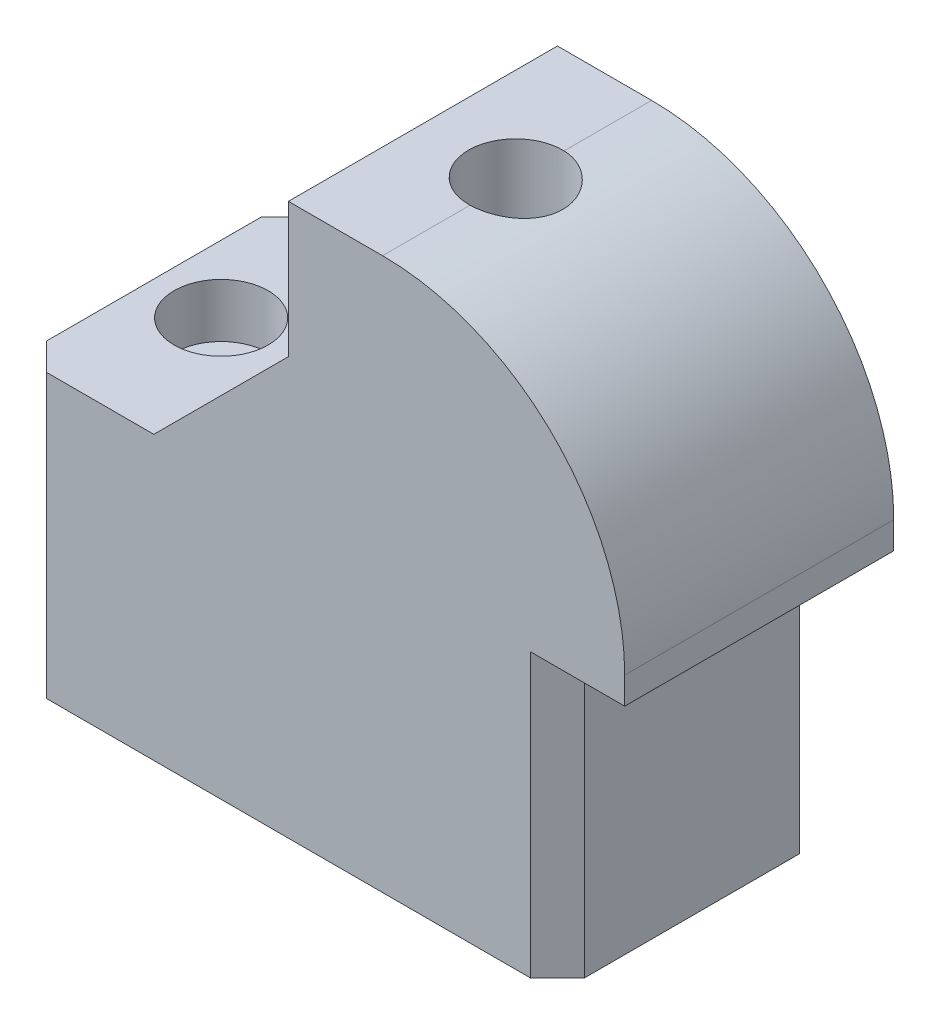
ISO-10303-21;
HEADER;
FILE_DESCRIPTION(('STEP AP214'),'2;1');
FILE_NAME('part.step','',(''),(''),'','','');
FILE_SCHEMA(('AUTOMOTIVE_DESIGN { 1 0 10303 214 1 1 1 1 }'));
ENDSEC;
DATA;
#1=APPLICATION_CONTEXT('core data for automotive mechanical design processes');
#2=APPLICATION_PROTOCOL_DEFINITION('international standard','automotive_design',2000,#1);
#3=PRODUCT_CONTEXT('',#1,'mechanical');
#4=PRODUCT('Part','Part','',(#3));
#5=PRODUCT_RELATED_PRODUCT_CATEGORY('part','',(#4));
#6=PRODUCT_DEFINITION_FORMATION('','',#4);
#7=PRODUCT_DEFINITION_CONTEXT('part definition',#1,'design');
#8=PRODUCT_DEFINITION('design','',#6,#7);
#9=PRODUCT_DEFINITION_SHAPE('','',#8);
#10=(LENGTH_UNIT() NAMED_UNIT(*) SI_UNIT(.MILLI.,.METRE.));
#11=(NAMED_UNIT(*) PLANE_ANGLE_UNIT() SI_UNIT($,.RADIAN.));
#12=(NAMED_UNIT(*) SI_UNIT($,.STERADIAN.) SOLID_ANGLE_UNIT());
#13=UNCERTAINTY_MEASURE_WITH_UNIT(LENGTH_MEASURE(1.E-05),#10,'distance_accuracy_value','');
#14=(GEOMETRIC_REPRESENTATION_CONTEXT(3) GLOBAL_UNCERTAINTY_ASSIGNED_CONTEXT((#13)) GLOBAL_UNIT_ASSIGNED_CONTEXT((#10,
#11,#12)) REPRESENTATION_CONTEXT('',''));
#15=CARTESIAN_POINT('',(0.,0.,0.));
#16=DIRECTION('',(0.,0.,1.));
#17=DIRECTION('',(1.,0.,0.));
#18=AXIS2_PLACEMENT_3D('',#15,#16,#17);
#19=CARTESIAN_POINT('',(-29.339108581,0.,0.));
#20=DIRECTION('',(0.,1.,0.));
#21=DIRECTION('',(0.,0.,1.));
#22=AXIS2_PLACEMENT_3D('',#19,#20,#21);
#23=CYLINDRICAL_SURFACE('',#22,2.413);
#24=CARTESIAN_POINT('',(-29.339108581,0.,0.));
#25=DIRECTION('',(0.,1.,0.));
#26=DIRECTION('',(0.,0.,1.));
#27=AXIS2_PLACEMENT_3D('',#24,#25,#26);
#28=CIRCLE('',#27,2.413);
#29=CARTESIAN_POINT('',(-29.339108581,0.,2.413));
#30=VERTEX_POINT('',#29);
#31=EDGE_CURVE('E449',#30,#30,#28,.T.);
#32=ORIENTED_EDGE('',*,*,#31,.F.);
#33=EDGE_LOOP('',(#32));
#34=FACE_BOUND('',#33,.T.);
#35=CARTESIAN_POINT('',(-29.339108581,21.59,0.));
#36=DIRECTION('',(0.,1.,0.));
#37=DIRECTION('',(0.,0.,1.));
#38=AXIS2_PLACEMENT_3D('',#35,#36,#37);
#39=CIRCLE('',#38,2.413);
#40=CARTESIAN_POINT('',(-29.339108581,21.59,2.413));
#41=VERTEX_POINT('',#40);
#42=EDGE_CURVE('E433',#41,#41,#39,.T.);
#43=ORIENTED_EDGE('',*,*,#42,.T.);
#44=EDGE_LOOP('',(#43));
#45=FACE_BOUND('',#44,.T.);
#46=ADVANCED_FACE('F43',(#34,#45),#23,.F.);
#47=CARTESIAN_POINT('',(-57.15,0.,0.));
#48=DIRECTION('',(0.,1.,0.));
#49=DIRECTION('',(0.,0.,1.));
#50=AXIS2_PLACEMENT_3D('',#47,#48,#49);
#51=CYLINDRICAL_SURFACE('',#50,2.413);
#52=CARTESIAN_POINT('',(-57.15,0.,0.));
#53=DIRECTION('',(0.,1.,0.));
#54=DIRECTION('',(0.,0.,1.));
#55=AXIS2_PLACEMENT_3D('',#52,#53,#54);
#56=CIRCLE('',#55,2.413);
#57=CARTESIAN_POINT('',(-57.15,0.,2.413));
#58=VERTEX_POINT('',#57);
#59=EDGE_CURVE('E175',#58,#58,#56,.T.);
#60=ORIENTED_EDGE('',*,*,#59,.F.);
#61=EDGE_LOOP('',(#60));
#62=FACE_BOUND('',#61,.T.);
#63=CARTESIAN_POINT('',(-57.15,21.59,0.));
#64=DIRECTION('',(0.,1.,0.));
#65=DIRECTION('',(0.,0.,1.));
#66=AXIS2_PLACEMENT_3D('',#63,#64,#65);
#67=CIRCLE('',#66,2.413);
#68=CARTESIAN_POINT('',(-57.15,21.59,2.413));
#69=VERTEX_POINT('',#68);
#70=EDGE_CURVE('E440',#69,#69,#67,.T.);
#71=ORIENTED_EDGE('',*,*,#70,.T.);
#72=EDGE_LOOP('',(#71));
#73=FACE_BOUND('',#72,.T.);
#74=ADVANCED_FACE('F324',(#62,#73),#51,.F.);
#75=CARTESIAN_POINT('',(-12.7,26.67,0.));
#76=DIRECTION('',(1.,0.,0.));
#77=DIRECTION('',(0.,0.,-1.));
#78=AXIS2_PLACEMENT_3D('',#75,#76,#77);
#79=PLANE('',#78);
#80=DIRECTION('',(0.,0.,1.));
#81=VECTOR('',#80,1.);
#82=CARTESIAN_POINT('',(-12.7,0.,0.));
#83=LINE('',#82,#81);
#84=CARTESIAN_POINT('',(-12.7,0.,-10.16));
#85=VERTEX_POINT('',#84);
#86=CARTESIAN_POINT('',(-12.7,0.,10.16));
#87=VERTEX_POINT('',#86);
#88=EDGE_CURVE('E231',#85,#87,#83,.T.);
#89=ORIENTED_EDGE('',*,*,#88,.F.);
#90=DIRECTION('',(0.,1.,0.));
#91=VECTOR('',#90,1.);
#92=CARTESIAN_POINT('',(-12.7,26.67,-10.16));
#93=LINE('',#92,#91);
#94=CARTESIAN_POINT('',(-12.7,26.67,-10.16));
#95=VERTEX_POINT('',#94);
#96=EDGE_CURVE('E273',#85,#95,#93,.T.);
#97=ORIENTED_EDGE('',*,*,#96,.T.);
#98=DIRECTION('',(0.,0.,1.));
#99=VECTOR('',#98,1.);
#100=CARTESIAN_POINT('',(-12.7,26.67,-12.7));
#101=LINE('',#100,#99);
#102=CARTESIAN_POINT('',(-12.7,26.67,10.16));
#103=VERTEX_POINT('',#102);
#104=EDGE_CURVE('E183',#95,#103,#101,.T.);
#105=ORIENTED_EDGE('',*,*,#104,.T.);
#106=DIRECTION('',(0.,-1.,0.));
#107=VECTOR('',#106,1.);
#108=CARTESIAN_POINT('',(-12.7,26.67,10.16));
#109=LINE('',#108,#107);
#110=EDGE_CURVE('E269',#103,#87,#109,.T.);
#111=ORIENTED_EDGE('',*,*,#110,.T.);
#112=EDGE_LOOP('',(#89,#97,#105,#111));
#113=FACE_BOUND('',#112,.T.);
#114=ADVANCED_FACE('F327',(#113),#79,.T.);
#115=CARTESIAN_POINT('',(-63.5,26.67,0.));
#116=DIRECTION('',(-1.,0.,0.));
#117=DIRECTION('',(0.,0.,1.));
#118=AXIS2_PLACEMENT_3D('',#115,#116,#117);
#119=PLANE('',#118);
#120=DIRECTION('',(0.,0.,-1.));
#121=VECTOR('',#120,1.);
#122=CARTESIAN_POINT('',(-63.5,0.,0.));
#123=LINE('',#122,#121);
#124=CARTESIAN_POINT('',(-63.5,0.,10.16));
#125=VERTEX_POINT('',#124);
#126=CARTESIAN_POINT('',(-63.5,0.,-10.16));
#127=VERTEX_POINT('',#126);
#128=EDGE_CURVE('E209',#125,#127,#123,.T.);
#129=ORIENTED_EDGE('',*,*,#128,.F.);
#130=DIRECTION('',(0.,1.,0.));
#131=VECTOR('',#130,1.);
#132=CARTESIAN_POINT('',(-63.5,26.67,10.16));
#133=LINE('',#132,#131);
#134=CARTESIAN_POINT('',(-63.5,26.67,10.16));
#135=VERTEX_POINT('',#134);
#136=EDGE_CURVE('E286',#125,#135,#133,.T.);
#137=ORIENTED_EDGE('',*,*,#136,.T.);
#138=DIRECTION('',(0.,0.,-1.));
#139=VECTOR('',#138,1.);
#140=CARTESIAN_POINT('',(-63.5,26.67,0.));
#141=LINE('',#140,#139);
#142=CARTESIAN_POINT('',(-63.5,26.67,-10.16));
#143=VERTEX_POINT('',#142);
#144=EDGE_CURVE('E210',#135,#143,#141,.T.);
#145=ORIENTED_EDGE('',*,*,#144,.T.);
#146=DIRECTION('',(0.,-1.,0.));
#147=VECTOR('',#146,1.);
#148=CARTESIAN_POINT('',(-63.5,0.,-10.16));
#149=LINE('',#148,#147);
#150=EDGE_CURVE('E282',#143,#127,#149,.T.);
#151=ORIENTED_EDGE('',*,*,#150,.T.);
#152=EDGE_LOOP('',(#129,#137,#145,#151));
#153=FACE_BOUND('',#152,.T.);
#154=ADVANCED_FACE('F358',(#153),#119,.T.);
#155=CARTESIAN_POINT('',(0.,26.67,12.7));
#156=DIRECTION('',(0.,0.,1.));
#157=DIRECTION('',(1.,0.,0.));
#158=AXIS2_PLACEMENT_3D('',#155,#156,#157);
#159=PLANE('',#158);
#160=DIRECTION('',(0.,-1.,0.));
#161=VECTOR('',#160,1.);
#162=CARTESIAN_POINT('',(-6.34999999999999,52.07,12.7));
#163=LINE('',#162,#161);
#164=CARTESIAN_POINT('',(-6.34999999999999,29.21,12.7));
#165=VERTEX_POINT('',#164);
#166=CARTESIAN_POINT('',(-6.34999999999999,26.67,12.7));
#167=VERTEX_POINT('',#166);
#168=EDGE_CURVE('E152',#165,#167,#163,.T.);
#169=ORIENTED_EDGE('',*,*,#168,.F.);
#170=CARTESIAN_POINT('',(-29.21,29.21,12.7));
#171=DIRECTION('',(0.,0.,1.));
#172=DIRECTION('',(1.,0.,0.));
#173=AXIS2_PLACEMENT_3D('',#170,#171,#172);
#174=CIRCLE('',#173,22.86);
#175=CARTESIAN_POINT('',(-29.21,52.07,12.7));
#176=VERTEX_POINT('',#175);
#177=EDGE_CURVE('E303',#165,#176,#174,.T.);
#178=ORIENTED_EDGE('',*,*,#177,.T.);
#179=DIRECTION('',(1.,0.,0.));
#180=VECTOR('',#179,1.);
#181=CARTESIAN_POINT('',(-12.7,52.07,12.7));
#182=LINE('',#181,#180);
#183=CARTESIAN_POINT('',(-38.1,52.07,12.7));
#184=VERTEX_POINT('',#183);
#185=EDGE_CURVE('E197',#184,#176,#182,.T.);
#186=ORIENTED_EDGE('',*,*,#185,.F.);
#187=DIRECTION('',(0.,-1.,0.));
#188=VECTOR('',#187,1.);
#189=CARTESIAN_POINT('',(-38.1,52.07,12.7));
#190=LINE('',#189,#188);
#191=CARTESIAN_POINT('',(-38.1,39.37,12.7));
#192=VERTEX_POINT('',#191);
#193=EDGE_CURVE('E201',#184,#192,#190,.T.);
#194=ORIENTED_EDGE('',*,*,#193,.T.);
#195=DIRECTION('',(-0.707106781186551,-0.707106781186544,0.));
#196=VECTOR('',#195,1.);
#197=CARTESIAN_POINT('',(-38.1,39.37,12.7));
#198=LINE('',#197,#196);
#199=CARTESIAN_POINT('',(-50.8000000000001,26.67,12.7));
#200=VERTEX_POINT('',#199);
#201=EDGE_CURVE('E244',#192,#200,#198,.T.);
#202=ORIENTED_EDGE('',*,*,#201,.T.);
#203=DIRECTION('',(-1.,0.,0.));
#204=VECTOR('',#203,1.);
#205=CARTESIAN_POINT('',(0.,26.67,12.7));
#206=LINE('',#205,#204);
#207=CARTESIAN_POINT('',(-60.96,26.67,12.7));
#208=VERTEX_POINT('',#207);
#209=EDGE_CURVE('E214',#200,#208,#206,.T.);
#210=ORIENTED_EDGE('',*,*,#209,.T.);
#211=DIRECTION('',(0.,-1.,0.));
#212=VECTOR('',#211,1.);
#213=CARTESIAN_POINT('',(-60.96,26.67,12.7));
#214=LINE('',#213,#212);
#215=CARTESIAN_POINT('',(-60.96,0.,12.7));
#216=VERTEX_POINT('',#215);
#217=EDGE_CURVE('E276',#208,#216,#214,.T.);
#218=ORIENTED_EDGE('',*,*,#217,.T.);
#219=DIRECTION('',(-1.,0.,0.));
#220=VECTOR('',#219,1.);
#221=CARTESIAN_POINT('',(0.,0.,12.7));
#222=LINE('',#221,#220);
#223=CARTESIAN_POINT('',(-15.24,0.,12.7));
#224=VERTEX_POINT('',#223);
#225=EDGE_CURVE('E227',#224,#216,#222,.T.);
#226=ORIENTED_EDGE('',*,*,#225,.F.);
#227=DIRECTION('',(0.,1.,0.));
#228=VECTOR('',#227,1.);
#229=CARTESIAN_POINT('',(-15.24,26.67,12.7));
#230=LINE('',#229,#228);
#231=CARTESIAN_POINT('',(-15.24,26.67,12.7));
#232=VERTEX_POINT('',#231);
#233=EDGE_CURVE('E171',#224,#232,#230,.T.);
#234=ORIENTED_EDGE('',*,*,#233,.T.);
#235=DIRECTION('',(1.,0.,0.));
#236=VECTOR('',#235,1.);
#237=CARTESIAN_POINT('',(-12.7,26.67,12.7));
#238=LINE('',#237,#236);
#239=EDGE_CURVE('E167',#232,#167,#238,.T.);
#240=ORIENTED_EDGE('',*,*,#239,.T.);
#241=EDGE_LOOP('',(#169,#178,#186,#194,#202,#210,#218,#226,#234,#240));
#242=FACE_BOUND('',#241,.T.);
#243=ADVANCED_FACE('F168',(#242),#159,.T.);
#244=CARTESIAN_POINT('',(0.,26.67,-12.7));
#245=DIRECTION('',(0.,0.,1.));
#246=DIRECTION('',(1.,0.,0.));
#247=AXIS2_PLACEMENT_3D('',#244,#245,#246);
#248=PLANE('',#247);
#249=DIRECTION('',(-1.,0.,0.));
#250=VECTOR('',#249,1.);
#251=CARTESIAN_POINT('',(-12.7,52.07,-12.7));
#252=LINE('',#251,#250);
#253=CARTESIAN_POINT('',(-29.21,52.07,-12.7));
#254=VERTEX_POINT('',#253);
#255=CARTESIAN_POINT('',(-38.1,52.07,-12.7));
#256=VERTEX_POINT('',#255);
#257=EDGE_CURVE('E163',#254,#256,#252,.T.);
#258=ORIENTED_EDGE('',*,*,#257,.F.);
#259=CARTESIAN_POINT('',(-29.21,29.21,-12.7));
#260=DIRECTION('',(0.,0.,1.));
#261=DIRECTION('',(1.,0.,0.));
#262=AXIS2_PLACEMENT_3D('',#259,#260,#261);
#263=CIRCLE('',#262,22.86);
#264=CARTESIAN_POINT('',(-6.35,29.21,-12.7));
#265=VERTEX_POINT('',#264);
#266=EDGE_CURVE('E11',#254,#265,#263,.F.);
#267=ORIENTED_EDGE('',*,*,#266,.T.);
#268=DIRECTION('',(0.,-1.,0.));
#269=VECTOR('',#268,1.);
#270=CARTESIAN_POINT('',(-6.35,52.07,-12.7));
#271=LINE('',#270,#269);
#272=CARTESIAN_POINT('',(-6.35,26.67,-12.7));
#273=VERTEX_POINT('',#272);
#274=EDGE_CURVE('E164',#265,#273,#271,.T.);
#275=ORIENTED_EDGE('',*,*,#274,.T.);
#276=DIRECTION('',(1.,0.,0.));
#277=VECTOR('',#276,1.);
#278=CARTESIAN_POINT('',(-12.7,26.67,-12.7));
#279=LINE('',#278,#277);
#280=CARTESIAN_POINT('',(-15.24,26.67,-12.7));
#281=VERTEX_POINT('',#280);
#282=EDGE_CURVE('E179',#281,#273,#279,.T.);
#283=ORIENTED_EDGE('',*,*,#282,.F.);
#284=DIRECTION('',(0.,-1.,0.));
#285=VECTOR('',#284,1.);
#286=CARTESIAN_POINT('',(-15.24,0.,-12.7));
#287=LINE('',#286,#285);
#288=CARTESIAN_POINT('',(-15.24,0.,-12.7));
#289=VERTEX_POINT('',#288);
#290=EDGE_CURVE('E253',#281,#289,#287,.T.);
#291=ORIENTED_EDGE('',*,*,#290,.T.);
#292=DIRECTION('',(-1.,0.,0.));
#293=VECTOR('',#292,1.);
#294=CARTESIAN_POINT('',(0.,0.,-12.7));
#295=LINE('',#294,#293);
#296=CARTESIAN_POINT('',(-60.96,0.,-12.7));
#297=VERTEX_POINT('',#296);
#298=EDGE_CURVE('E215',#289,#297,#295,.T.);
#299=ORIENTED_EDGE('',*,*,#298,.T.);
#300=DIRECTION('',(0.,1.,0.));
#301=VECTOR('',#300,1.);
#302=CARTESIAN_POINT('',(-60.96,26.67,-12.7));
#303=LINE('',#302,#301);
#304=CARTESIAN_POINT('',(-60.96,26.67,-12.7));
#305=VERTEX_POINT('',#304);
#306=EDGE_CURVE('E250',#297,#305,#303,.T.);
#307=ORIENTED_EDGE('',*,*,#306,.T.);
#308=DIRECTION('',(-1.,0.,0.));
#309=VECTOR('',#308,1.);
#310=CARTESIAN_POINT('',(0.,26.67,-12.7));
#311=LINE('',#310,#309);
#312=CARTESIAN_POINT('',(-50.8000000000001,26.67,-12.7));
#313=VERTEX_POINT('',#312);
#314=EDGE_CURVE('E219',#313,#305,#311,.T.);
#315=ORIENTED_EDGE('',*,*,#314,.F.);
#316=DIRECTION('',(0.707106781186551,0.707106781186544,0.));
#317=VECTOR('',#316,1.);
#318=CARTESIAN_POINT('',(-25.3999999999998,52.0700000000001,-12.7));
#319=LINE('',#318,#317);
#320=CARTESIAN_POINT('',(-38.1,39.37,-12.7));
#321=VERTEX_POINT('',#320);
#322=EDGE_CURVE('E247',#313,#321,#319,.T.);
#323=ORIENTED_EDGE('',*,*,#322,.T.);
#324=DIRECTION('',(0.,-1.,0.));
#325=VECTOR('',#324,1.);
#326=CARTESIAN_POINT('',(-38.1,52.07,-12.7));
#327=LINE('',#326,#325);
#328=EDGE_CURVE('E205',#256,#321,#327,.T.);
#329=ORIENTED_EDGE('',*,*,#328,.F.);
#330=EDGE_LOOP('',(#258,#267,#275,#283,#291,#299,#307,#315,#323,#329));
#331=FACE_BOUND('',#330,.T.);
#332=ADVANCED_FACE('F348',(#331),#248,.F.);
#333=CARTESIAN_POINT('',(0.,26.67,0.));
#334=DIRECTION('',(0.,1.,0.));
#335=DIRECTION('',(0.,0.,1.));
#336=AXIS2_PLACEMENT_3D('',#333,#334,#335);
#337=PLANE('',#336);
#338=CARTESIAN_POINT('',(-57.15,26.67,0.));
#339=DIRECTION('',(0.,1.,0.));
#340=DIRECTION('',(0.,0.,1.));
#341=AXIS2_PLACEMENT_3D('',#338,#339,#340);
#342=CIRCLE('',#341,4.445);
#343=CARTESIAN_POINT('',(-57.15,26.67,4.445));
#344=VERTEX_POINT('',#343);
#345=EDGE_CURVE('E444',#344,#344,#342,.T.);
#346=ORIENTED_EDGE('',*,*,#345,.F.);
#347=EDGE_LOOP('',(#346));
#348=FACE_BOUND('',#347,.T.);
#349=ORIENTED_EDGE('',*,*,#144,.F.);
#350=DIRECTION('',(-0.707106781186546,0.,-0.70710678118655));
#351=VECTOR('',#350,1.);
#352=CARTESIAN_POINT('',(-36.8300000000002,26.67,36.83));
#353=LINE('',#352,#351);
#354=EDGE_CURVE('E292',#135,#208,#353,.F.);
#355=ORIENTED_EDGE('',*,*,#354,.T.);
#356=ORIENTED_EDGE('',*,*,#209,.F.);
#357=DIRECTION('',(0.,0.,-1.));
#358=VECTOR('',#357,1.);
#359=CARTESIAN_POINT('',(-50.8000000000001,26.67,0.));
#360=LINE('',#359,#358);
#361=EDGE_CURVE('E241',#200,#313,#360,.T.);
#362=ORIENTED_EDGE('',*,*,#361,.T.);
#363=ORIENTED_EDGE('',*,*,#314,.T.);
#364=DIRECTION('',(-0.70710678118655,0.,0.707106781186545));
#365=VECTOR('',#364,1.);
#366=CARTESIAN_POINT('',(-36.8299999999997,26.67,-36.83));
#367=LINE('',#366,#365);
#368=EDGE_CURVE('E289',#305,#143,#367,.T.);
#369=ORIENTED_EDGE('',*,*,#368,.T.);
#370=EDGE_LOOP('',(#349,#355,#356,#362,#363,#369));
#371=FACE_BOUND('',#370,.T.);
#372=ADVANCED_FACE('F345',(#348,#371),#337,.T.);
#373=CARTESIAN_POINT('',(0.,0.,0.));
#374=DIRECTION('',(0.,1.,0.));
#375=DIRECTION('',(0.,0.,1.));
#376=AXIS2_PLACEMENT_3D('',#373,#374,#375);
#377=PLANE('',#376);
#378=ORIENTED_EDGE('',*,*,#59,.T.);
#379=EDGE_LOOP('',(#378));
#380=FACE_BOUND('',#379,.T.);
#381=ORIENTED_EDGE('',*,*,#31,.T.);
#382=EDGE_LOOP('',(#381));
#383=FACE_BOUND('',#382,.T.);
#384=ORIENTED_EDGE('',*,*,#298,.F.);
#385=DIRECTION('',(0.707106781186546,0.,0.707106781186549));
#386=VECTOR('',#385,1.);
#387=CARTESIAN_POINT('',(-15.24,0.,-12.7));
#388=LINE('',#387,#386);
#389=EDGE_CURVE('E266',#289,#85,#388,.T.);
#390=ORIENTED_EDGE('',*,*,#389,.T.);
#391=ORIENTED_EDGE('',*,*,#88,.T.);
#392=DIRECTION('',(0.707106781186549,0.,-0.707106781186547));
#393=VECTOR('',#392,1.);
#394=CARTESIAN_POINT('',(-12.7,0.,10.16));
#395=LINE('',#394,#393);
#396=EDGE_CURVE('E263',#87,#224,#395,.F.);
#397=ORIENTED_EDGE('',*,*,#396,.T.);
#398=ORIENTED_EDGE('',*,*,#225,.T.);
#399=DIRECTION('',(0.707106781186546,0.,0.70710678118655));
#400=VECTOR('',#399,1.);
#401=CARTESIAN_POINT('',(-60.96,0.,12.7));
#402=LINE('',#401,#400);
#403=EDGE_CURVE('E260',#216,#125,#402,.F.);
#404=ORIENTED_EDGE('',*,*,#403,.T.);
#405=ORIENTED_EDGE('',*,*,#128,.T.);
#406=DIRECTION('',(0.70710678118655,0.,-0.707106781186545));
#407=VECTOR('',#406,1.);
#408=CARTESIAN_POINT('',(-63.5,0.,-10.16));
#409=LINE('',#408,#407);
#410=EDGE_CURVE('E257',#127,#297,#409,.T.);
#411=ORIENTED_EDGE('',*,*,#410,.T.);
#412=EDGE_LOOP('',(#384,#390,#391,#397,#398,#404,#405,#411));
#413=FACE_BOUND('',#412,.T.);
#414=ADVANCED_FACE('F343',(#380,#383,#413),#377,.F.);
#415=CARTESIAN_POINT('',(-38.1,52.07,-12.7));
#416=DIRECTION('',(1.,0.,0.));
#417=DIRECTION('',(0.,0.,-1.));
#418=AXIS2_PLACEMENT_3D('',#415,#416,#417);
#419=PLANE('',#418);
#420=ORIENTED_EDGE('',*,*,#328,.T.);
#421=DIRECTION('',(0.,0.,1.));
#422=VECTOR('',#421,1.);
#423=CARTESIAN_POINT('',(-38.1,39.37,-12.7));
#424=LINE('',#423,#422);
#425=EDGE_CURVE('E223',#321,#192,#424,.T.);
#426=ORIENTED_EDGE('',*,*,#425,.T.);
#427=ORIENTED_EDGE('',*,*,#193,.F.);
#428=DIRECTION('',(0.,0.,1.));
#429=VECTOR('',#428,1.);
#430=CARTESIAN_POINT('',(-38.1,52.07,-12.7));
#431=LINE('',#430,#429);
#432=EDGE_CURVE('E194',#256,#184,#431,.T.);
#433=ORIENTED_EDGE('',*,*,#432,.F.);
#434=EDGE_LOOP('',(#420,#426,#427,#433));
#435=FACE_BOUND('',#434,.T.);
#436=ADVANCED_FACE('F340',(#435),#419,.F.);
#437=CARTESIAN_POINT('',(0.,52.07,0.));
#438=DIRECTION('',(0.,-1.,0.));
#439=DIRECTION('',(0.,0.,-1.));
#440=AXIS2_PLACEMENT_3D('',#437,#438,#439);
#441=PLANE('',#440);
#442=ORIENTED_EDGE('',*,*,#185,.T.);
#443=DIRECTION('',(0.,0.,1.));
#444=VECTOR('',#443,1.);
#445=CARTESIAN_POINT('',(-29.21,52.07,-12.7));
#446=LINE('',#445,#444);
#447=CARTESIAN_POINT('',(-29.21,52.07,4.44312457335062));
#448=VERTEX_POINT('',#447);
#449=EDGE_CURVE('E308',#176,#448,#446,.F.);
#450=ORIENTED_EDGE('',*,*,#449,.T.);
#451=CARTESIAN_POINT('',(-29.339108581,52.07,0.));
#452=DIRECTION('',(0.,-1.,0.));
#453=DIRECTION('',(0.,0.,-1.));
#454=AXIS2_PLACEMENT_3D('',#451,#452,#453);
#455=CIRCLE('',#454,4.445);
#456=CARTESIAN_POINT('',(-29.21,52.07,-4.44312457335062));
#457=VERTEX_POINT('',#456);
#458=EDGE_CURVE('E430',#457,#448,#455,.F.);
#459=ORIENTED_EDGE('',*,*,#458,.F.);
#460=DIRECTION('',(0.,0.,1.));
#461=VECTOR('',#460,1.);
#462=CARTESIAN_POINT('',(-29.21,52.07,-12.7));
#463=LINE('',#462,#461);
#464=EDGE_CURVE('E60',#457,#254,#463,.F.);
#465=ORIENTED_EDGE('',*,*,#464,.T.);
#466=ORIENTED_EDGE('',*,*,#257,.T.);
#467=ORIENTED_EDGE('',*,*,#432,.T.);
#468=EDGE_LOOP('',(#442,#450,#459,#465,#466,#467));
#469=FACE_BOUND('',#468,.T.);
#470=ADVANCED_FACE('F337',(#469),#441,.F.);
#471=CARTESIAN_POINT('',(-6.35,52.07,-12.7));
#472=DIRECTION('',(1.,0.,0.));
#473=DIRECTION('',(0.,0.,-1.));
#474=AXIS2_PLACEMENT_3D('',#471,#472,#473);
#475=PLANE('',#474);
#476=ORIENTED_EDGE('',*,*,#274,.F.);
#477=DIRECTION('',(0.,0.,1.));
#478=VECTOR('',#477,1.);
#479=CARTESIAN_POINT('',(-6.34999999999999,29.21,12.7));
#480=LINE('',#479,#478);
#481=EDGE_CURVE('E160',#265,#165,#480,.T.);
#482=ORIENTED_EDGE('',*,*,#481,.T.);
#483=ORIENTED_EDGE('',*,*,#168,.T.);
#484=DIRECTION('',(0.,0.,1.));
#485=VECTOR('',#484,1.);
#486=CARTESIAN_POINT('',(-6.35,26.67,-12.7));
#487=LINE('',#486,#485);
#488=EDGE_CURVE('E157',#273,#167,#487,.T.);
#489=ORIENTED_EDGE('',*,*,#488,.F.);
#490=EDGE_LOOP('',(#476,#482,#483,#489));
#491=FACE_BOUND('',#490,.T.);
#492=ADVANCED_FACE('F155',(#491),#475,.T.);
#493=CARTESIAN_POINT('',(0.,26.67,0.));
#494=DIRECTION('',(0.,-1.,0.));
#495=DIRECTION('',(0.,0.,-1.));
#496=AXIS2_PLACEMENT_3D('',#493,#494,#495);
#497=PLANE('',#496);
#498=ORIENTED_EDGE('',*,*,#239,.F.);
#499=DIRECTION('',(-0.707106781186549,0.,0.707106781186547));
#500=VECTOR('',#499,1.);
#501=CARTESIAN_POINT('',(-12.7,26.67,10.16));
#502=LINE('',#501,#500);
#503=EDGE_CURVE('E298',#232,#103,#502,.F.);
#504=ORIENTED_EDGE('',*,*,#503,.T.);
#505=ORIENTED_EDGE('',*,*,#104,.F.);
#506=DIRECTION('',(-0.707106781186546,0.,-0.707106781186549));
#507=VECTOR('',#506,1.);
#508=CARTESIAN_POINT('',(-15.24,26.67,-12.7));
#509=LINE('',#508,#507);
#510=EDGE_CURVE('E295',#95,#281,#509,.T.);
#511=ORIENTED_EDGE('',*,*,#510,.T.);
#512=ORIENTED_EDGE('',*,*,#282,.T.);
#513=ORIENTED_EDGE('',*,*,#488,.T.);
#514=EDGE_LOOP('',(#498,#504,#505,#511,#512,#513));
#515=FACE_BOUND('',#514,.T.);
#516=ADVANCED_FACE('F177',(#515),#497,.T.);
#517=CARTESIAN_POINT('',(-38.1,39.37,-12.7));
#518=DIRECTION('',(0.707106781186544,-0.707106781186551,0.));
#519=DIRECTION('',(0.,0.,1.));
#520=AXIS2_PLACEMENT_3D('',#517,#518,#519);
#521=PLANE('',#520);
#522=ORIENTED_EDGE('',*,*,#322,.F.);
#523=ORIENTED_EDGE('',*,*,#361,.F.);
#524=ORIENTED_EDGE('',*,*,#201,.F.);
#525=ORIENTED_EDGE('',*,*,#425,.F.);
#526=EDGE_LOOP('',(#522,#523,#524,#525));
#527=FACE_BOUND('',#526,.T.);
#528=ADVANCED_FACE('F334',(#527),#521,.F.);
#529=CARTESIAN_POINT('',(-57.15,21.59,0.));
#530=DIRECTION('',(0.,1.,0.));
#531=DIRECTION('',(0.,0.,1.));
#532=AXIS2_PLACEMENT_3D('',#529,#530,#531);
#533=CYLINDRICAL_SURFACE('',#532,4.445);
#534=CARTESIAN_POINT('',(-57.15,21.59,0.));
#535=DIRECTION('',(0.,1.,0.));
#536=DIRECTION('',(0.,0.,1.));
#537=AXIS2_PLACEMENT_3D('',#534,#535,#536);
#538=CIRCLE('',#537,4.445);
#539=CARTESIAN_POINT('',(-57.15,21.59,4.445));
#540=VERTEX_POINT('',#539);
#541=EDGE_CURVE('E445',#540,#540,#538,.T.);
#542=CARTESIAN_POINT('',(-57.15,21.59,4.445));
#543=CARTESIAN_POINT('',(-57.15,21.6429166666667,4.445));
#544=CARTESIAN_POINT('',(-57.15,21.6958333333333,4.445));
#545=CARTESIAN_POINT('',(-57.15,21.8016666666667,4.445));
#546=CARTESIAN_POINT('',(-57.15,21.8545833333333,4.445));
#547=CARTESIAN_POINT('',(-57.15,21.9604166666667,4.445));
#548=CARTESIAN_POINT('',(-57.15,22.0133333333333,4.445));
#549=CARTESIAN_POINT('',(-57.15,22.1191666666667,4.445));
#550=CARTESIAN_POINT('',(-57.15,22.1720833333333,4.445));
#551=CARTESIAN_POINT('',(-57.15,22.2779166666667,4.445));
#552=CARTESIAN_POINT('',(-57.15,22.3308333333333,4.445));
#553=CARTESIAN_POINT('',(-57.15,22.4366666666667,4.445));
#554=CARTESIAN_POINT('',(-57.15,22.4895833333333,4.445));
#555=CARTESIAN_POINT('',(-57.15,22.5954166666667,4.445));
#556=CARTESIAN_POINT('',(-57.15,22.6483333333333,4.445));
#557=CARTESIAN_POINT('',(-57.15,22.7541666666667,4.445));
#558=CARTESIAN_POINT('',(-57.15,22.8070833333333,4.445));
#559=CARTESIAN_POINT('',(-57.15,22.9129166666667,4.445));
#560=CARTESIAN_POINT('',(-57.15,22.9658333333333,4.445));
#561=CARTESIAN_POINT('',(-57.15,23.0716666666667,4.445));
#562=CARTESIAN_POINT('',(-57.15,23.1245833333333,4.445));
#563=CARTESIAN_POINT('',(-57.15,23.2304166666667,4.445));
#564=CARTESIAN_POINT('',(-57.15,23.2833333333333,4.445));
#565=CARTESIAN_POINT('',(-57.15,23.3891666666667,4.445));
#566=CARTESIAN_POINT('',(-57.15,23.4420833333333,4.445));
#567=CARTESIAN_POINT('',(-57.15,23.5479166666667,4.445));
#568=CARTESIAN_POINT('',(-57.15,23.6008333333333,4.445));
#569=CARTESIAN_POINT('',(-57.15,23.7066666666667,4.445));
#570=CARTESIAN_POINT('',(-57.15,23.7595833333333,4.445));
#571=CARTESIAN_POINT('',(-57.15,23.8654166666667,4.445));
#572=CARTESIAN_POINT('',(-57.15,23.9183333333333,4.445));
#573=CARTESIAN_POINT('',(-57.15,24.0241666666667,4.445));
#574=CARTESIAN_POINT('',(-57.15,24.0770833333333,4.445));
#575=CARTESIAN_POINT('',(-57.15,24.1829166666667,4.445));
#576=CARTESIAN_POINT('',(-57.15,24.2358333333333,4.445));
#577=CARTESIAN_POINT('',(-57.15,24.3416666666667,4.445));
#578=CARTESIAN_POINT('',(-57.15,24.3945833333333,4.445));
#579=CARTESIAN_POINT('',(-57.15,24.5004166666667,4.445));
#580=CARTESIAN_POINT('',(-57.15,24.5533333333333,4.445));
#581=CARTESIAN_POINT('',(-57.15,24.6591666666667,4.445));
#582=CARTESIAN_POINT('',(-57.15,24.7120833333333,4.445));
#583=CARTESIAN_POINT('',(-57.15,24.8179166666667,4.445));
#584=CARTESIAN_POINT('',(-57.15,24.8708333333333,4.445));
#585=CARTESIAN_POINT('',(-57.15,24.9766666666667,4.445));
#586=CARTESIAN_POINT('',(-57.15,25.0295833333333,4.445));
#587=CARTESIAN_POINT('',(-57.15,25.1354166666667,4.445));
#588=CARTESIAN_POINT('',(-57.15,25.1883333333333,4.445));
#589=CARTESIAN_POINT('',(-57.15,25.2941666666667,4.445));
#590=CARTESIAN_POINT('',(-57.15,25.3470833333333,4.445));
#591=CARTESIAN_POINT('',(-57.15,25.4529166666667,4.445));
#592=CARTESIAN_POINT('',(-57.15,25.5058333333333,4.445));
#593=CARTESIAN_POINT('',(-57.15,25.6116666666667,4.445));
#594=CARTESIAN_POINT('',(-57.15,25.6645833333333,4.445));
#595=CARTESIAN_POINT('',(-57.15,25.7704166666667,4.445));
#596=CARTESIAN_POINT('',(-57.15,25.8233333333333,4.445));
#597=CARTESIAN_POINT('',(-57.15,25.9291666666667,4.445));
#598=CARTESIAN_POINT('',(-57.15,25.9820833333333,4.445));
#599=CARTESIAN_POINT('',(-57.15,26.0879166666667,4.445));
#600=CARTESIAN_POINT('',(-57.15,26.1408333333333,4.445));
#601=CARTESIAN_POINT('',(-57.15,26.2466666666667,4.445));
#602=CARTESIAN_POINT('',(-57.15,26.2995833333333,4.445));
#603=CARTESIAN_POINT('',(-57.15,26.4054166666667,4.445));
#604=CARTESIAN_POINT('',(-57.15,26.4583333333333,4.445));
#605=CARTESIAN_POINT('',(-57.15,26.5641666666667,4.445));
#606=CARTESIAN_POINT('',(-57.15,26.6170833333333,4.445));
#607=CARTESIAN_POINT('',(-57.15,26.67,4.445));
#608=B_SPLINE_CURVE_WITH_KNOTS('',3,(#542,#543,#544,#545,#546,#547,#548,#549,#550,#551,#552,
#553,#554,#555,#556,#557,#558,#559,#560,#561,#562,#563,#564,#565,#566,#567,#568,#569,#570,#571,
#572,#573,#574,#575,#576,#577,#578,#579,#580,#581,#582,#583,#584,#585,#586,#587,#588,#589,#590,
#591,#592,#593,#594,#595,#596,#597,#598,#599,#600,#601,#602,#603,#604,#605,#606,#607),
.UNSPECIFIED.,.F.,.F.,(4,2,2,2,2,2,2,2,2,2,2,2,2,2,2,2,2,2,2,2,2,2,2,2,2,2,2,2,2,2,2,2,4),(0.,
0.158749999999999,0.317499999999998,0.476249999999998,0.634999999999997,0.793749999999996,
0.952499999999998,1.11125,1.27,1.42875,1.5875,1.74625,1.905,2.06375,2.2225,2.38124999999999,
2.53999999999999,2.69875,2.8575,3.01624999999999,3.17499999999999,3.33374999999999,3.4925,
3.65124999999999,3.80999999999999,3.96874999999999,4.12749999999999,4.28624999999999,
4.44499999999999,4.60374999999999,4.76249999999999,4.92124999999999,5.07999999999999),.UNSPECIFIED.);
#609=EDGE_CURVE('BSEAM371',#540,#344,#608,.T.);
#610=ORIENTED_EDGE('',*,*,#541,.F.);
#611=ORIENTED_EDGE('',*,*,#345,.T.);
#612=ORIENTED_EDGE('',*,*,#609,.T.);
#613=ORIENTED_EDGE('',*,*,#609,.F.);
#614=EDGE_LOOP('',(#610,#612,#611,#613));
#615=FACE_BOUND('',#614,.T.);
#616=ADVANCED_FACE('F371',(#615),#533,.F.);
#617=CARTESIAN_POINT('',(-57.15,21.59,0.));
#618=DIRECTION('',(0.,1.,0.));
#619=DIRECTION('',(0.,0.,1.));
#620=AXIS2_PLACEMENT_3D('',#617,#618,#619);
#621=PLANE('',#620);
#622=ORIENTED_EDGE('',*,*,#70,.F.);
#623=EDGE_LOOP('',(#622));
#624=FACE_BOUND('',#623,.T.);
#625=ORIENTED_EDGE('',*,*,#541,.T.);
#626=EDGE_LOOP('',(#625));
#627=FACE_BOUND('',#626,.T.);
#628=ADVANCED_FACE('F322',(#624,#627),#621,.T.);
#629=CARTESIAN_POINT('',(-29.339108581,21.59,0.));
#630=DIRECTION('',(0.,1.,0.));
#631=DIRECTION('',(0.,0.,1.));
#632=AXIS2_PLACEMENT_3D('',#629,#630,#631);
#633=CYLINDRICAL_SURFACE('',#632,4.445);
#634=ORIENTED_EDGE('',*,*,#458,.T.);
#635=CARTESIAN_POINT('',(-29.21,52.07,4.44312457335062));
#636=CARTESIAN_POINT('',(-29.0862108478753,52.0700098825212,4.43954205438547));
#637=CARTESIAN_POINT('',(-28.962576910134,52.0689948317724,4.43075789409284));
#638=CARTESIAN_POINT('',(-28.7165169174384,52.0650014721257,4.40291928876782));
#639=CARTESIAN_POINT('',(-28.5940907218658,52.0620233945893,4.38386605409237));
#640=CARTESIAN_POINT('',(-28.3514878630946,52.0541961583083,4.3356559263542));
#641=CARTESIAN_POINT('',(-28.2313082302747,52.0493496844066,4.3065135372763));
#642=CARTESIAN_POINT('',(-27.9938704904067,52.0379379463722,4.23835055792262));
#643=CARTESIAN_POINT('',(-27.8766123925021,52.0313726768609,4.19932993673501));
#644=CARTESIAN_POINT('',(-27.6458348485442,52.0167172240944,4.11169985546926));
#645=CARTESIAN_POINT('',(-27.5323151689332,52.0086271363153,4.06309099574731));
#646=CARTESIAN_POINT('',(-27.3097748038009,51.9911596102115,3.95664891313884));
#647=CARTESIAN_POINT('',(-27.2007558005206,51.9817816960952,3.89881227973759));
#648=CARTESIAN_POINT('',(-26.8816535798784,51.9521165727923,3.71208034194493));
#649=CARTESIAN_POINT('',(-26.6792946480454,51.9302825286492,3.56987514766223));
#650=CARTESIAN_POINT('',(-26.2989737124725,51.8847168108428,3.25234541067838));
#651=CARTESIAN_POINT('',(-26.1213125132712,51.860966516871,3.07666552094226));
#652=CARTESIAN_POINT('',(-25.7977611190352,51.8144901306144,2.69794084964732));
#653=CARTESIAN_POINT('',(-25.6518757685684,51.7917641949223,2.49489190301177));
#654=CARTESIAN_POINT('',(-25.3951000590641,51.7498150834946,2.06539964307396));
#655=CARTESIAN_POINT('',(-25.2844697053663,51.7306183551693,1.83879815227372));
#656=CARTESIAN_POINT('',(-25.1029711003006,51.6982295851324,1.36980394454128));
#657=CARTESIAN_POINT('',(-25.0320968702773,51.6850366406087,1.12741360810956));
#658=CARTESIAN_POINT('',(-24.9329686347634,51.6663831271813,0.63698383803474));
#659=CARTESIAN_POINT('',(-24.9041854029602,51.660826597213,0.389055064031458));
#660=CARTESIAN_POINT('',(-24.8884702581429,51.657807342551,-0.108169295294168));
#661=CARTESIAN_POINT('',(-24.9015358302652,51.6603441314969,-0.357464797585536));
#662=CARTESIAN_POINT('',(-24.9686671329836,51.6731212394525,-0.847107689035264));
#663=CARTESIAN_POINT('',(-25.0222250583821,51.6832661343517,-1.08752752773913));
#664=CARTESIAN_POINT('',(-25.1681054747486,51.7099585726124,-1.55593243507335));
#665=CARTESIAN_POINT('',(-25.260430166836,51.7265064795231,-1.78391679680515));
#666=CARTESIAN_POINT('',(-25.4819936838007,51.7642514981126,-2.22298835883026));
#667=CARTESIAN_POINT('',(-25.6115184886482,51.7854843206422,-2.43392777348379));
#668=CARTESIAN_POINT('',(-25.9036853320415,51.8301149095897,-2.83136802716722));
#669=CARTESIAN_POINT('',(-26.0663281924069,51.8535127297237,-3.01786825955354));
#670=CARTESIAN_POINT('',(-26.3329568223258,51.8884138941579,-3.27670751209551));
#671=CARTESIAN_POINT('',(-26.4264532324527,51.9001078921641,-3.36008344685611));
#672=CARTESIAN_POINT('',(-26.6201695944439,51.9230331640068,-3.51866972963969));
#673=CARTESIAN_POINT('',(-26.7203870891425,51.9342646045521,-3.59388303579661));
#674=CARTESIAN_POINT('',(-26.9269504581953,51.9559464475521,-3.73567017881329));
#675=CARTESIAN_POINT('',(-27.0333012828339,51.9663962030222,-3.80223689190197));
#676=CARTESIAN_POINT('',(-27.2512869265124,51.9861939860565,-3.92616039543995));
#677=CARTESIAN_POINT('',(-27.3629196936729,51.9955424365994,-3.9835207248771));
#678=CARTESIAN_POINT('',(-27.5907127893339,52.0128628462954,-4.08862700475339));
#679=CARTESIAN_POINT('',(-27.7068726667531,52.020834942161,-4.13637391016604));
#680=CARTESIAN_POINT('',(-27.9428599641673,52.0351598285113,-4.22187838614846));
#681=CARTESIAN_POINT('',(-28.0626859045219,52.0415132628852,-4.25963992903469));
#682=CARTESIAN_POINT('',(-28.304980386327,52.0523997119621,-4.3248492639006));
#683=CARTESIAN_POINT('',(-28.4274443532186,52.0569356466406,-4.35231359466921));
#684=CARTESIAN_POINT('',(-28.6742573474437,52.0640543821627,-4.39678344529835));
#685=CARTESIAN_POINT('',(-28.7986051734054,52.0666383783927,-4.41379536512505));
#686=CARTESIAN_POINT('',(-28.971104320135,52.0688015806073,-4.42999939996176));
#687=CARTESIAN_POINT('',(-29.0188545471736,52.0692508589461,-4.43370693050725));
#688=CARTESIAN_POINT('',(-29.1143938749442,52.0698498927079,-4.43957369615351));
#689=CARTESIAN_POINT('',(-29.1621828586454,52.0700000100558,-4.44173480008826));
#690=CARTESIAN_POINT('',(-29.21,52.07,-4.44312457335062));
#691=B_SPLINE_CURVE_WITH_KNOTS('',3,(#635,#636,#637,#638,#639,#640,#641,#642,#643,#644,#645,
#646,#647,#648,#649,#650,#651,#652,#653,#654,#655,#656,#657,#658,#659,#660,#661,#662,#663,#664,
#665,#666,#667,#668,#669,#670,#671,#672,#673,#674,#675,#676,#677,#678,#679,#680,#681,#682,#683,
#684,#685,#686,#687,#688,#689,#690),.UNSPECIFIED.,.F.,.F.,(4,2,2,2,2,2,2,2,2,2,2,2,2,2,2,2,2,2,
2,2,2,2,2,2,2,2,2,4),(0.,0.371403914792174,0.742764063903254,1.1135925541463,1.4844222048327,
1.85522864382638,2.22617244887808,2.96732774520122,3.71683967417609,4.46646579439695,
5.22149889579824,5.97641842240098,6.72176192274521,7.46706063323222,8.20316463606192,
8.93931043943769,9.68127429253218,10.4232565595964,10.800339732885,11.1772857917852,
11.554540466076,11.9316497723235,12.3087215989729,12.6856431947521,13.0619567806593,
13.4380397211594,13.5817076999735,13.7252017635631),.UNSPECIFIED.);
#692=EDGE_CURVE('E53',#448,#457,#691,.T.);
#693=ORIENTED_EDGE('',*,*,#692,.T.);
#694=EDGE_LOOP('',(#634,#693));
#695=FACE_BOUND('',#694,.T.);
#696=CARTESIAN_POINT('',(-29.339108581,21.59,0.));
#697=DIRECTION('',(0.,1.,0.));
#698=DIRECTION('',(0.,0.,1.));
#699=AXIS2_PLACEMENT_3D('',#696,#697,#698);
#700=CIRCLE('',#699,4.445);
#701=CARTESIAN_POINT('',(-29.339108581,21.59,4.445));
#702=VERTEX_POINT('',#701);
#703=EDGE_CURVE('E437',#702,#702,#700,.T.);
#704=ORIENTED_EDGE('',*,*,#703,.F.);
#705=EDGE_LOOP('',(#704));
#706=FACE_BOUND('',#705,.T.);
#707=ADVANCED_FACE('F316',(#695,#706),#633,.F.);
#708=CARTESIAN_POINT('',(-29.339108581,21.59,0.));
#709=DIRECTION('',(0.,1.,0.));
#710=DIRECTION('',(0.,0.,1.));
#711=AXIS2_PLACEMENT_3D('',#708,#709,#710);
#712=PLANE('',#711);
#713=ORIENTED_EDGE('',*,*,#42,.F.);
#714=EDGE_LOOP('',(#713));
#715=FACE_BOUND('',#714,.T.);
#716=ORIENTED_EDGE('',*,*,#703,.T.);
#717=EDGE_LOOP('',(#716));
#718=FACE_BOUND('',#717,.T.);
#719=ADVANCED_FACE('F321',(#715,#718),#712,.T.);
#720=CARTESIAN_POINT('',(-15.24,26.67,-12.7));
#721=DIRECTION('',(0.707106781186549,0.,-0.707106781186546));
#722=DIRECTION('',(0.,1.,0.));
#723=AXIS2_PLACEMENT_3D('',#720,#721,#722);
#724=PLANE('',#723);
#725=ORIENTED_EDGE('',*,*,#510,.F.);
#726=ORIENTED_EDGE('',*,*,#96,.F.);
#727=ORIENTED_EDGE('',*,*,#389,.F.);
#728=ORIENTED_EDGE('',*,*,#290,.F.);
#729=EDGE_LOOP('',(#725,#726,#727,#728));
#730=FACE_BOUND('',#729,.T.);
#731=ADVANCED_FACE('F373',(#730),#724,.T.);
#732=CARTESIAN_POINT('',(-12.7,26.67,10.16));
#733=DIRECTION('',(-0.707106781186546,0.,-0.707106781186548));
#734=DIRECTION('',(0.,-1.,0.));
#735=AXIS2_PLACEMENT_3D('',#732,#733,#734);
#736=PLANE('',#735);
#737=ORIENTED_EDGE('',*,*,#503,.F.);
#738=ORIENTED_EDGE('',*,*,#233,.F.);
#739=ORIENTED_EDGE('',*,*,#396,.F.);
#740=ORIENTED_EDGE('',*,*,#110,.F.);
#741=EDGE_LOOP('',(#737,#738,#739,#740));
#742=FACE_BOUND('',#741,.T.);
#743=ADVANCED_FACE('F379',(#742),#736,.F.);
#744=CARTESIAN_POINT('',(-60.96,26.67,12.7));
#745=DIRECTION('',(0.70710678118655,0.,-0.707106781186546));
#746=DIRECTION('',(0.,-1.,0.));
#747=AXIS2_PLACEMENT_3D('',#744,#745,#746);
#748=PLANE('',#747);
#749=ORIENTED_EDGE('',*,*,#354,.F.);
#750=ORIENTED_EDGE('',*,*,#136,.F.);
#751=ORIENTED_EDGE('',*,*,#403,.F.);
#752=ORIENTED_EDGE('',*,*,#217,.F.);
#753=EDGE_LOOP('',(#749,#750,#751,#752));
#754=FACE_BOUND('',#753,.T.);
#755=ADVANCED_FACE('F386',(#754),#748,.F.);
#756=CARTESIAN_POINT('',(-63.5,26.67,-10.16));
#757=DIRECTION('',(-0.707106781186545,0.,-0.70710678118655));
#758=DIRECTION('',(0.,1.,0.));
#759=AXIS2_PLACEMENT_3D('',#756,#757,#758);
#760=PLANE('',#759);
#761=ORIENTED_EDGE('',*,*,#368,.F.);
#762=ORIENTED_EDGE('',*,*,#306,.F.);
#763=ORIENTED_EDGE('',*,*,#410,.F.);
#764=ORIENTED_EDGE('',*,*,#150,.F.);
#765=EDGE_LOOP('',(#761,#762,#763,#764));
#766=FACE_BOUND('',#765,.T.);
#767=ADVANCED_FACE('F392',(#766),#760,.T.);
#768=CARTESIAN_POINT('',(-29.21,29.21,-12.7));
#769=DIRECTION('',(0.,0.,-1.));
#770=DIRECTION('',(-1.,0.,0.));
#771=AXIS2_PLACEMENT_3D('',#768,#769,#770);
#772=CYLINDRICAL_SURFACE('',#771,22.86);
#773=ORIENTED_EDGE('',*,*,#692,.F.);
#774=ORIENTED_EDGE('',*,*,#449,.F.);
#775=ORIENTED_EDGE('',*,*,#177,.F.);
#776=ORIENTED_EDGE('',*,*,#481,.F.);
#777=ORIENTED_EDGE('',*,*,#266,.F.);
#778=ORIENTED_EDGE('',*,*,#464,.F.);
#779=EDGE_LOOP('',(#773,#774,#775,#776,#777,#778));
#780=FACE_BOUND('',#779,.T.);
#781=ADVANCED_FACE('F45',(#780),#772,.T.);
#782=CLOSED_SHELL('',(#46,#74,#114,#154,#243,#332,#372,#414,#436,#470,#492,#516,#528,#616,#628,
#707,#719,#731,#743,#755,#767,#781));
#783=MANIFOLD_SOLID_BREP('B2',#782);
#784=ADVANCED_BREP_SHAPE_REPRESENTATION('',(#18,#783),#14);
#785=SHAPE_DEFINITION_REPRESENTATION(#9,#784);
ENDSEC;
END-ISO-10303-21;
